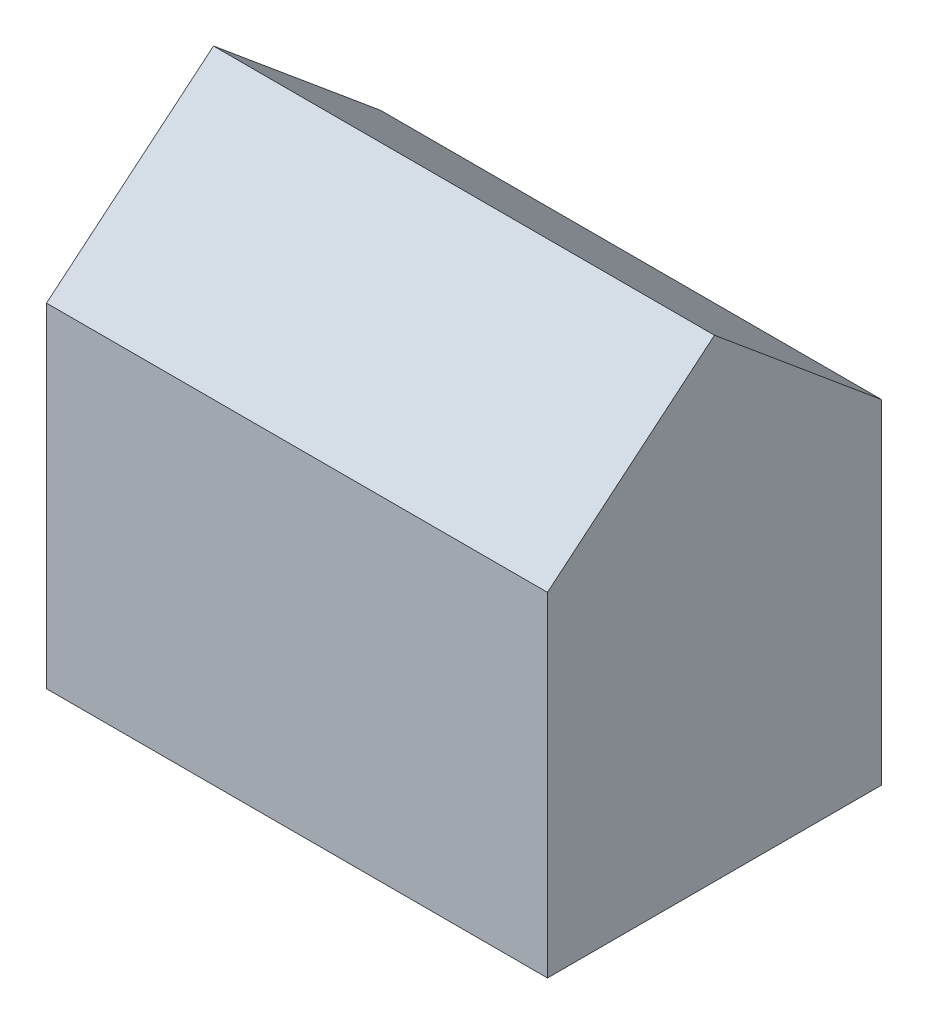
ISO-10303-21;
HEADER;
FILE_DESCRIPTION(('STEP AP214'),'2;1');
FILE_NAME('part.step','',(''),(''),'','','');
FILE_SCHEMA(('AUTOMOTIVE_DESIGN { 1 0 10303 214 1 1 1 1 }'));
ENDSEC;
DATA;
#1=APPLICATION_CONTEXT('core data for automotive mechanical design processes');
#2=APPLICATION_PROTOCOL_DEFINITION('international standard','automotive_design',2000,#1);
#3=PRODUCT_CONTEXT('',#1,'mechanical');
#4=PRODUCT('Part','Part','',(#3));
#5=PRODUCT_RELATED_PRODUCT_CATEGORY('part','',(#4));
#6=PRODUCT_DEFINITION_FORMATION('','',#4);
#7=PRODUCT_DEFINITION_CONTEXT('part definition',#1,'design');
#8=PRODUCT_DEFINITION('design','',#6,#7);
#9=PRODUCT_DEFINITION_SHAPE('','',#8);
#10=(LENGTH_UNIT() NAMED_UNIT(*) SI_UNIT(.MILLI.,.METRE.));
#11=(NAMED_UNIT(*) PLANE_ANGLE_UNIT() SI_UNIT($,.RADIAN.));
#12=(NAMED_UNIT(*) SI_UNIT($,.STERADIAN.) SOLID_ANGLE_UNIT());
#13=UNCERTAINTY_MEASURE_WITH_UNIT(LENGTH_MEASURE(1.E-05),#10,'distance_accuracy_value','');
#14=(GEOMETRIC_REPRESENTATION_CONTEXT(3) GLOBAL_UNCERTAINTY_ASSIGNED_CONTEXT((#13)) GLOBAL_UNIT_ASSIGNED_CONTEXT((#10,
#11,#12)) REPRESENTATION_CONTEXT('',''));
#15=CARTESIAN_POINT('',(0.,0.,0.));
#16=DIRECTION('',(0.,0.,1.));
#17=DIRECTION('',(1.,0.,0.));
#18=AXIS2_PLACEMENT_3D('',#15,#16,#17);
#19=CARTESIAN_POINT('',(0.,0.,0.));
#20=DIRECTION('',(0.,-1.,0.));
#21=DIRECTION('',(0.,0.,-1.));
#22=AXIS2_PLACEMENT_3D('',#19,#20,#21);
#23=PLANE('',#22);
#24=DIRECTION('',(0.,0.,1.));
#25=VECTOR('',#24,1.);
#26=CARTESIAN_POINT('',(0.,0.,0.));
#27=LINE('',#26,#25);
#28=CARTESIAN_POINT('',(0.,0.,-12.));
#29=VERTEX_POINT('',#28);
#30=CARTESIAN_POINT('',(0.,0.,0.));
#31=VERTEX_POINT('',#30);
#32=EDGE_CURVE('E170',#29,#31,#27,.T.);
#33=ORIENTED_EDGE('',*,*,#32,.F.);
#34=DIRECTION('',(-1.,0.,0.));
#35=VECTOR('',#34,1.);
#36=CARTESIAN_POINT('',(0.,0.,-12.));
#37=LINE('',#36,#35);
#38=CARTESIAN_POINT('',(18.,0.,-12.));
#39=VERTEX_POINT('',#38);
#40=EDGE_CURVE('E77',#39,#29,#37,.T.);
#41=ORIENTED_EDGE('',*,*,#40,.F.);
#42=DIRECTION('',(0.,0.,-1.));
#43=VECTOR('',#42,1.);
#44=CARTESIAN_POINT('',(18.,0.,0.));
#45=LINE('',#44,#43);
#46=CARTESIAN_POINT('',(18.,0.,0.));
#47=VERTEX_POINT('',#46);
#48=EDGE_CURVE('E175',#47,#39,#45,.T.);
#49=ORIENTED_EDGE('',*,*,#48,.F.);
#50=DIRECTION('',(1.,0.,0.));
#51=VECTOR('',#50,1.);
#52=CARTESIAN_POINT('',(0.,0.,0.));
#53=LINE('',#52,#51);
#54=EDGE_CURVE('E173',#31,#47,#53,.T.);
#55=ORIENTED_EDGE('',*,*,#54,.F.);
#56=EDGE_LOOP('',(#33,#41,#49,#55));
#57=FACE_BOUND('',#56,.T.);
#58=DIRECTION('',(-1.,0.,0.));
#59=VECTOR('',#58,1.);
#60=CARTESIAN_POINT('',(2.,0.,-10.));
#61=LINE('',#60,#59);
#62=CARTESIAN_POINT('',(16.,0.,-10.));
#63=VERTEX_POINT('',#62);
#64=CARTESIAN_POINT('',(2.,0.,-10.));
#65=VERTEX_POINT('',#64);
#66=EDGE_CURVE('E144',#63,#65,#61,.T.);
#67=ORIENTED_EDGE('',*,*,#66,.T.);
#68=DIRECTION('',(0.,0.,1.));
#69=VECTOR('',#68,1.);
#70=CARTESIAN_POINT('',(2.,0.,-2.));
#71=LINE('',#70,#69);
#72=CARTESIAN_POINT('',(2.,0.,-2.));
#73=VERTEX_POINT('',#72);
#74=EDGE_CURVE('E48',#65,#73,#71,.T.);
#75=ORIENTED_EDGE('',*,*,#74,.T.);
#76=DIRECTION('',(1.,0.,0.));
#77=VECTOR('',#76,1.);
#78=CARTESIAN_POINT('',(2.,0.,-2.));
#79=LINE('',#78,#77);
#80=CARTESIAN_POINT('',(16.,0.,-2.));
#81=VERTEX_POINT('',#80);
#82=EDGE_CURVE('E155',#73,#81,#79,.T.);
#83=ORIENTED_EDGE('',*,*,#82,.T.);
#84=DIRECTION('',(0.,0.,-1.));
#85=VECTOR('',#84,1.);
#86=CARTESIAN_POINT('',(16.,0.,-2.));
#87=LINE('',#86,#85);
#88=EDGE_CURVE('E158',#81,#63,#87,.T.);
#89=ORIENTED_EDGE('',*,*,#88,.T.);
#90=EDGE_LOOP('',(#67,#75,#83,#89));
#91=FACE_BOUND('',#90,.T.);
#92=ADVANCED_FACE('F33',(#57,#91),#23,.T.);
#93=CARTESIAN_POINT('',(0.,12.,0.));
#94=DIRECTION('',(1.,0.,0.));
#95=DIRECTION('',(0.,0.,-1.));
#96=AXIS2_PLACEMENT_3D('',#93,#94,#95);
#97=PLANE('',#96);
#98=ORIENTED_EDGE('',*,*,#32,.T.);
#99=DIRECTION('',(0.,-1.,0.));
#100=VECTOR('',#99,1.);
#101=CARTESIAN_POINT('',(0.,12.,0.));
#102=LINE('',#101,#100);
#103=CARTESIAN_POINT('',(0.,12.,0.));
#104=VERTEX_POINT('',#103);
#105=EDGE_CURVE('E11',#104,#31,#102,.T.);
#106=ORIENTED_EDGE('',*,*,#105,.F.);
#107=DIRECTION('',(0.,-0.640184399664481,0.768221279597375));
#108=VECTOR('',#107,1.);
#109=CARTESIAN_POINT('',(0.,17.,-6.));
#110=LINE('',#109,#108);
#111=CARTESIAN_POINT('',(0.,17.,-6.));
#112=VERTEX_POINT('',#111);
#113=EDGE_CURVE('E130',#112,#104,#110,.T.);
#114=ORIENTED_EDGE('',*,*,#113,.F.);
#115=DIRECTION('',(0.,0.640184399664481,0.768221279597375));
#116=VECTOR('',#115,1.);
#117=CARTESIAN_POINT('',(0.,17.,-6.));
#118=LINE('',#117,#116);
#119=CARTESIAN_POINT('',(0.,12.,-12.));
#120=VERTEX_POINT('',#119);
#121=EDGE_CURVE('E125',#120,#112,#118,.T.);
#122=ORIENTED_EDGE('',*,*,#121,.F.);
#123=DIRECTION('',(0.,-1.,0.));
#124=VECTOR('',#123,1.);
#125=CARTESIAN_POINT('',(0.,12.,-12.));
#126=LINE('',#125,#124);
#127=EDGE_CURVE('E112',#120,#29,#126,.T.);
#128=ORIENTED_EDGE('',*,*,#127,.T.);
#129=EDGE_LOOP('',(#98,#106,#114,#122,#128));
#130=FACE_BOUND('',#129,.T.);
#131=ADVANCED_FACE('F35',(#130),#97,.F.);
#132=CARTESIAN_POINT('',(0.,12.,0.));
#133=DIRECTION('',(0.,0.,-1.));
#134=DIRECTION('',(-1.,0.,0.));
#135=AXIS2_PLACEMENT_3D('',#132,#133,#134);
#136=PLANE('',#135);
#137=ORIENTED_EDGE('',*,*,#54,.T.);
#138=DIRECTION('',(0.,-1.,0.));
#139=VECTOR('',#138,1.);
#140=CARTESIAN_POINT('',(18.,12.,0.));
#141=LINE('',#140,#139);
#142=CARTESIAN_POINT('',(18.,12.,0.));
#143=VERTEX_POINT('',#142);
#144=EDGE_CURVE('E41',#143,#47,#141,.T.);
#145=ORIENTED_EDGE('',*,*,#144,.F.);
#146=DIRECTION('',(1.,0.,0.));
#147=VECTOR('',#146,1.);
#148=CARTESIAN_POINT('',(0.,12.,0.));
#149=LINE('',#148,#147);
#150=EDGE_CURVE('E82',#104,#143,#149,.T.);
#151=ORIENTED_EDGE('',*,*,#150,.F.);
#152=ORIENTED_EDGE('',*,*,#105,.T.);
#153=EDGE_LOOP('',(#137,#145,#151,#152));
#154=FACE_BOUND('',#153,.T.);
#155=ADVANCED_FACE('F202',(#154),#136,.F.);
#156=CARTESIAN_POINT('',(18.,12.,0.));
#157=DIRECTION('',(-1.,0.,0.));
#158=DIRECTION('',(0.,0.,1.));
#159=AXIS2_PLACEMENT_3D('',#156,#157,#158);
#160=PLANE('',#159);
#161=ORIENTED_EDGE('',*,*,#48,.T.);
#162=DIRECTION('',(0.,-1.,0.));
#163=VECTOR('',#162,1.);
#164=CARTESIAN_POINT('',(18.,12.,-12.));
#165=LINE('',#164,#163);
#166=CARTESIAN_POINT('',(18.,12.,-12.));
#167=VERTEX_POINT('',#166);
#168=EDGE_CURVE('E57',#167,#39,#165,.T.);
#169=ORIENTED_EDGE('',*,*,#168,.F.);
#170=DIRECTION('',(0.,0.640184399664481,0.768221279597375));
#171=VECTOR('',#170,1.);
#172=CARTESIAN_POINT('',(18.,17.,-6.));
#173=LINE('',#172,#171);
#174=CARTESIAN_POINT('',(18.,17.,-6.));
#175=VERTEX_POINT('',#174);
#176=EDGE_CURVE('E127',#167,#175,#173,.T.);
#177=ORIENTED_EDGE('',*,*,#176,.T.);
#178=DIRECTION('',(0.,-0.640184399664481,0.768221279597375));
#179=VECTOR('',#178,1.);
#180=CARTESIAN_POINT('',(18.,17.,-6.));
#181=LINE('',#180,#179);
#182=EDGE_CURVE('E131',#175,#143,#181,.T.);
#183=ORIENTED_EDGE('',*,*,#182,.T.);
#184=ORIENTED_EDGE('',*,*,#144,.T.);
#185=EDGE_LOOP('',(#161,#169,#177,#183,#184));
#186=FACE_BOUND('',#185,.T.);
#187=ADVANCED_FACE('F180',(#186),#160,.F.);
#188=CARTESIAN_POINT('',(0.,12.,-12.));
#189=DIRECTION('',(0.,0.,1.));
#190=DIRECTION('',(1.,0.,0.));
#191=AXIS2_PLACEMENT_3D('',#188,#189,#190);
#192=PLANE('',#191);
#193=ORIENTED_EDGE('',*,*,#40,.T.);
#194=ORIENTED_EDGE('',*,*,#127,.F.);
#195=DIRECTION('',(-1.,0.,0.));
#196=VECTOR('',#195,1.);
#197=CARTESIAN_POINT('',(0.,12.,-12.));
#198=LINE('',#197,#196);
#199=EDGE_CURVE('E115',#167,#120,#198,.T.);
#200=ORIENTED_EDGE('',*,*,#199,.F.);
#201=ORIENTED_EDGE('',*,*,#168,.T.);
#202=EDGE_LOOP('',(#193,#194,#200,#201));
#203=FACE_BOUND('',#202,.T.);
#204=ADVANCED_FACE('F114',(#203),#192,.F.);
#205=CARTESIAN_POINT('',(2.,12.,-2.));
#206=DIRECTION('',(1.,0.,0.));
#207=DIRECTION('',(0.,0.,-1.));
#208=AXIS2_PLACEMENT_3D('',#205,#206,#207);
#209=PLANE('',#208);
#210=ORIENTED_EDGE('',*,*,#74,.F.);
#211=DIRECTION('',(0.,-1.,0.));
#212=VECTOR('',#211,1.);
#213=CARTESIAN_POINT('',(2.,12.,-10.));
#214=LINE('',#213,#212);
#215=CARTESIAN_POINT('',(2.,12.,-10.));
#216=VERTEX_POINT('',#215);
#217=EDGE_CURVE('E153',#216,#65,#214,.T.);
#218=ORIENTED_EDGE('',*,*,#217,.F.);
#219=DIRECTION('',(0.,0.,1.));
#220=VECTOR('',#219,1.);
#221=CARTESIAN_POINT('',(2.,12.,-2.));
#222=LINE('',#221,#220);
#223=CARTESIAN_POINT('',(2.,12.,-2.));
#224=VERTEX_POINT('',#223);
#225=EDGE_CURVE('E140',#216,#224,#222,.T.);
#226=ORIENTED_EDGE('',*,*,#225,.T.);
#227=DIRECTION('',(0.,-1.,0.));
#228=VECTOR('',#227,1.);
#229=CARTESIAN_POINT('',(2.,12.,-2.));
#230=LINE('',#229,#228);
#231=EDGE_CURVE('E168',#224,#73,#230,.T.);
#232=ORIENTED_EDGE('',*,*,#231,.T.);
#233=EDGE_LOOP('',(#210,#218,#226,#232));
#234=FACE_BOUND('',#233,.T.);
#235=ADVANCED_FACE('F205',(#234),#209,.T.);
#236=CARTESIAN_POINT('',(2.,12.,-2.));
#237=DIRECTION('',(0.,0.,-1.));
#238=DIRECTION('',(-1.,0.,0.));
#239=AXIS2_PLACEMENT_3D('',#236,#237,#238);
#240=PLANE('',#239);
#241=ORIENTED_EDGE('',*,*,#82,.F.);
#242=ORIENTED_EDGE('',*,*,#231,.F.);
#243=DIRECTION('',(1.,0.,0.));
#244=VECTOR('',#243,1.);
#245=CARTESIAN_POINT('',(2.,12.,-2.));
#246=LINE('',#245,#244);
#247=CARTESIAN_POINT('',(16.,12.,-2.));
#248=VERTEX_POINT('',#247);
#249=EDGE_CURVE('E143',#224,#248,#246,.T.);
#250=ORIENTED_EDGE('',*,*,#249,.T.);
#251=DIRECTION('',(0.,-1.,0.));
#252=VECTOR('',#251,1.);
#253=CARTESIAN_POINT('',(16.,12.,-2.));
#254=LINE('',#253,#252);
#255=EDGE_CURVE('E166',#248,#81,#254,.T.);
#256=ORIENTED_EDGE('',*,*,#255,.T.);
#257=EDGE_LOOP('',(#241,#242,#250,#256));
#258=FACE_BOUND('',#257,.T.);
#259=ADVANCED_FACE('F229',(#258),#240,.T.);
#260=CARTESIAN_POINT('',(16.,12.,-2.));
#261=DIRECTION('',(-1.,0.,0.));
#262=DIRECTION('',(0.,0.,1.));
#263=AXIS2_PLACEMENT_3D('',#260,#261,#262);
#264=PLANE('',#263);
#265=ORIENTED_EDGE('',*,*,#88,.F.);
#266=ORIENTED_EDGE('',*,*,#255,.F.);
#267=DIRECTION('',(0.,0.,-1.));
#268=VECTOR('',#267,1.);
#269=CARTESIAN_POINT('',(16.,12.,-2.));
#270=LINE('',#269,#268);
#271=CARTESIAN_POINT('',(16.,12.,-10.));
#272=VERTEX_POINT('',#271);
#273=EDGE_CURVE('E147',#248,#272,#270,.T.);
#274=ORIENTED_EDGE('',*,*,#273,.T.);
#275=DIRECTION('',(0.,-1.,0.));
#276=VECTOR('',#275,1.);
#277=CARTESIAN_POINT('',(16.,12.,-10.));
#278=LINE('',#277,#276);
#279=EDGE_CURVE('E164',#272,#63,#278,.T.);
#280=ORIENTED_EDGE('',*,*,#279,.T.);
#281=EDGE_LOOP('',(#265,#266,#274,#280));
#282=FACE_BOUND('',#281,.T.);
#283=ADVANCED_FACE('F235',(#282),#264,.T.);
#284=CARTESIAN_POINT('',(2.,12.,-10.));
#285=DIRECTION('',(0.,0.,1.));
#286=DIRECTION('',(1.,0.,0.));
#287=AXIS2_PLACEMENT_3D('',#284,#285,#286);
#288=PLANE('',#287);
#289=ORIENTED_EDGE('',*,*,#66,.F.);
#290=ORIENTED_EDGE('',*,*,#279,.F.);
#291=DIRECTION('',(-1.,0.,0.));
#292=VECTOR('',#291,1.);
#293=CARTESIAN_POINT('',(2.,12.,-10.));
#294=LINE('',#293,#292);
#295=EDGE_CURVE('E150',#272,#216,#294,.T.);
#296=ORIENTED_EDGE('',*,*,#295,.T.);
#297=ORIENTED_EDGE('',*,*,#217,.T.);
#298=EDGE_LOOP('',(#289,#290,#296,#297));
#299=FACE_BOUND('',#298,.T.);
#300=ADVANCED_FACE('F194',(#299),#288,.T.);
#301=CARTESIAN_POINT('',(0.,12.,-12.));
#302=DIRECTION('',(0.,-1.,0.));
#303=DIRECTION('',(0.,0.,-1.));
#304=AXIS2_PLACEMENT_3D('',#301,#302,#303);
#305=PLANE('',#304);
#306=ORIENTED_EDGE('',*,*,#249,.F.);
#307=ORIENTED_EDGE('',*,*,#225,.F.);
#308=ORIENTED_EDGE('',*,*,#295,.F.);
#309=ORIENTED_EDGE('',*,*,#273,.F.);
#310=EDGE_LOOP('',(#306,#307,#308,#309));
#311=FACE_BOUND('',#310,.T.);
#312=ADVANCED_FACE('F187',(#311),#305,.T.);
#313=CARTESIAN_POINT('',(0.,17.,-6.));
#314=DIRECTION('',(0.,0.768221279597375,0.640184399664481));
#315=DIRECTION('',(0.,-0.640184399664481,0.768221279597375));
#316=AXIS2_PLACEMENT_3D('',#313,#314,#315);
#317=PLANE('',#316);
#318=ORIENTED_EDGE('',*,*,#182,.F.);
#319=DIRECTION('',(1.,0.,0.));
#320=VECTOR('',#319,1.);
#321=CARTESIAN_POINT('',(0.,17.,-6.));
#322=LINE('',#321,#320);
#323=EDGE_CURVE('E133',#112,#175,#322,.T.);
#324=ORIENTED_EDGE('',*,*,#323,.F.);
#325=ORIENTED_EDGE('',*,*,#113,.T.);
#326=ORIENTED_EDGE('',*,*,#150,.T.);
#327=EDGE_LOOP('',(#318,#324,#325,#326));
#328=FACE_BOUND('',#327,.T.);
#329=ADVANCED_FACE('F185',(#328),#317,.T.);
#330=CARTESIAN_POINT('',(0.,17.,-6.));
#331=DIRECTION('',(0.,0.768221279597375,-0.640184399664481));
#332=DIRECTION('',(0.,0.640184399664481,0.768221279597375));
#333=AXIS2_PLACEMENT_3D('',#330,#331,#332);
#334=PLANE('',#333);
#335=ORIENTED_EDGE('',*,*,#176,.F.);
#336=ORIENTED_EDGE('',*,*,#199,.T.);
#337=ORIENTED_EDGE('',*,*,#121,.T.);
#338=ORIENTED_EDGE('',*,*,#323,.T.);
#339=EDGE_LOOP('',(#335,#336,#337,#338));
#340=FACE_BOUND('',#339,.T.);
#341=ADVANCED_FACE('F124',(#340),#334,.T.);
#342=CLOSED_SHELL('',(#92,#131,#155,#187,#204,#235,#259,#283,#300,#312,#329,#341));
#343=MANIFOLD_SOLID_BREP('B2',#342);
#344=ADVANCED_BREP_SHAPE_REPRESENTATION('',(#18,#343),#14);
#345=SHAPE_DEFINITION_REPRESENTATION(#9,#344);
ENDSEC;
END-ISO-10303-21;
